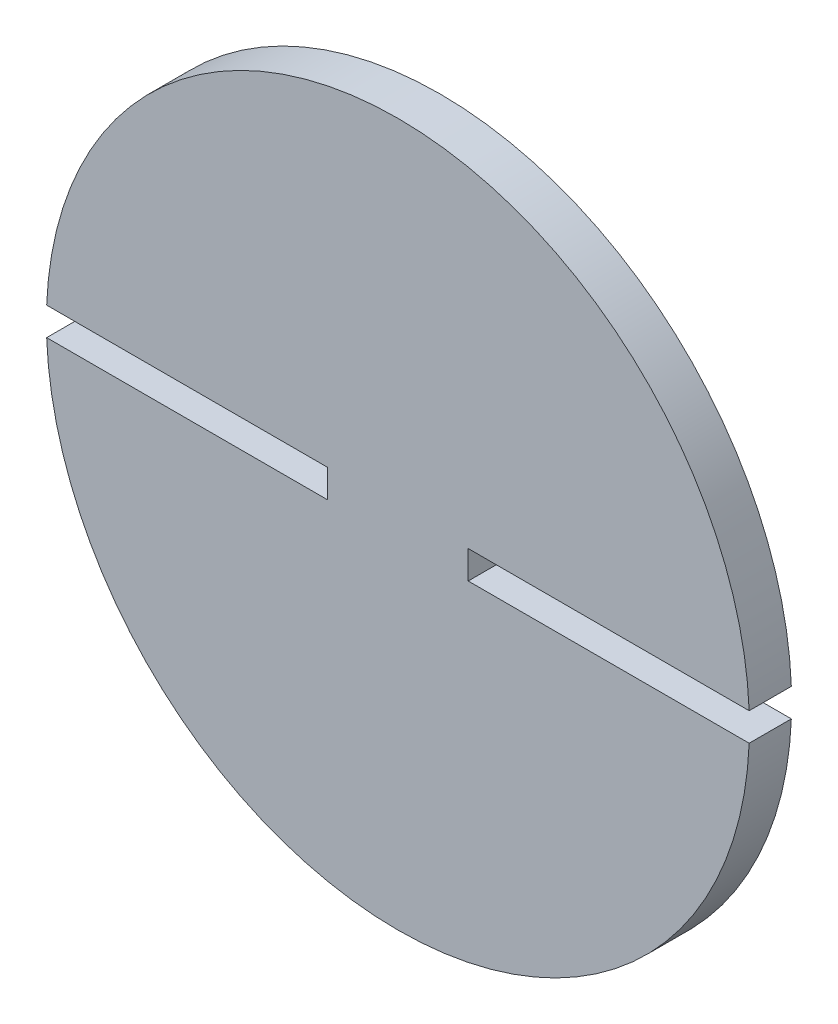
ISO-10303-21;
HEADER;
FILE_DESCRIPTION(('STEP AP214'),'2;1');
FILE_NAME('part.step','',(''),(''),'','','');
FILE_SCHEMA(('AUTOMOTIVE_DESIGN { 1 0 10303 214 1 1 1 1 }'));
ENDSEC;
DATA;
#1=APPLICATION_CONTEXT('core data for automotive mechanical design processes');
#2=APPLICATION_PROTOCOL_DEFINITION('international standard','automotive_design',2000,#1);
#3=PRODUCT_CONTEXT('',#1,'mechanical');
#4=PRODUCT('Part','Part','',(#3));
#5=PRODUCT_RELATED_PRODUCT_CATEGORY('part','',(#4));
#6=PRODUCT_DEFINITION_FORMATION('','',#4);
#7=PRODUCT_DEFINITION_CONTEXT('part definition',#1,'design');
#8=PRODUCT_DEFINITION('design','',#6,#7);
#9=PRODUCT_DEFINITION_SHAPE('','',#8);
#10=(LENGTH_UNIT() NAMED_UNIT(*) SI_UNIT(.MILLI.,.METRE.));
#11=(NAMED_UNIT(*) PLANE_ANGLE_UNIT() SI_UNIT($,.RADIAN.));
#12=(NAMED_UNIT(*) SI_UNIT($,.STERADIAN.) SOLID_ANGLE_UNIT());
#13=UNCERTAINTY_MEASURE_WITH_UNIT(LENGTH_MEASURE(1.E-05),#10,'distance_accuracy_value','');
#14=(GEOMETRIC_REPRESENTATION_CONTEXT(3) GLOBAL_UNCERTAINTY_ASSIGNED_CONTEXT((#13)) GLOBAL_UNIT_ASSIGNED_CONTEXT((#10,
#11,#12)) REPRESENTATION_CONTEXT('',''));
#15=CARTESIAN_POINT('',(0.,0.,0.));
#16=DIRECTION('',(0.,0.,1.));
#17=DIRECTION('',(1.,0.,0.));
#18=AXIS2_PLACEMENT_3D('',#15,#16,#17);
#19=CARTESIAN_POINT('',(0.,0.,3.));
#20=DIRECTION('',(0.,0.,-1.));
#21=DIRECTION('',(-1.,0.,0.));
#22=AXIS2_PLACEMENT_3D('',#19,#20,#21);
#23=CYLINDRICAL_SURFACE('',#22,25.);
#24=DIRECTION('',(0.,0.,-1.));
#25=VECTOR('',#24,1.);
#26=CARTESIAN_POINT('',(-24.9799919935936,1.,3.));
#27=LINE('',#26,#25);
#28=CARTESIAN_POINT('',(-24.9799919935936,1.,3.));
#29=VERTEX_POINT('',#28);
#30=CARTESIAN_POINT('',(-24.9799919935936,1.,0.));
#31=VERTEX_POINT('',#30);
#32=EDGE_CURVE('E129',#29,#31,#27,.T.);
#33=ORIENTED_EDGE('',*,*,#32,.F.);
#34=CARTESIAN_POINT('',(0.,0.,3.));
#35=DIRECTION('',(0.,0.,1.));
#36=DIRECTION('',(1.,0.,0.));
#37=AXIS2_PLACEMENT_3D('',#34,#35,#36);
#38=CIRCLE('',#37,25.);
#39=CARTESIAN_POINT('',(24.9799919935936,0.999999999999999,3.));
#40=VERTEX_POINT('',#39);
#41=EDGE_CURVE('E11',#40,#29,#38,.T.);
#42=ORIENTED_EDGE('',*,*,#41,.F.);
#43=DIRECTION('',(0.,0.,-1.));
#44=VECTOR('',#43,1.);
#45=CARTESIAN_POINT('',(24.9799919935936,0.999999999999999,3.));
#46=LINE('',#45,#44);
#47=CARTESIAN_POINT('',(24.9799919935936,0.999999999999999,0.));
#48=VERTEX_POINT('',#47);
#49=EDGE_CURVE('E151',#40,#48,#46,.T.);
#50=ORIENTED_EDGE('',*,*,#49,.T.);
#51=CARTESIAN_POINT('',(0.,0.,0.));
#52=DIRECTION('',(0.,0.,1.));
#53=DIRECTION('',(1.,0.,0.));
#54=AXIS2_PLACEMENT_3D('',#51,#52,#53);
#55=CIRCLE('',#54,25.);
#56=EDGE_CURVE('E37',#48,#31,#55,.T.);
#57=ORIENTED_EDGE('',*,*,#56,.T.);
#58=EDGE_LOOP('',(#33,#42,#50,#57));
#59=FACE_BOUND('',#58,.T.);
#60=ADVANCED_FACE('F33',(#59),#23,.T.);
#61=CARTESIAN_POINT('',(0.,0.,3.));
#62=DIRECTION('',(0.,0.,1.));
#63=DIRECTION('',(1.,0.,0.));
#64=AXIS2_PLACEMENT_3D('',#61,#62,#63);
#65=PLANE('',#64);
#66=ORIENTED_EDGE('',*,*,#41,.T.);
#67=DIRECTION('',(-1.,0.,0.));
#68=VECTOR('',#67,1.);
#69=CARTESIAN_POINT('',(0.,1.,3.));
#70=LINE('',#69,#68);
#71=CARTESIAN_POINT('',(-5.,1.,3.));
#72=VERTEX_POINT('',#71);
#73=EDGE_CURVE('E107',#72,#29,#70,.T.);
#74=ORIENTED_EDGE('',*,*,#73,.F.);
#75=DIRECTION('',(0.,1.,0.));
#76=VECTOR('',#75,1.);
#77=CARTESIAN_POINT('',(-5.,0.,3.));
#78=LINE('',#77,#76);
#79=CARTESIAN_POINT('',(-5.,-1.,3.));
#80=VERTEX_POINT('',#79);
#81=EDGE_CURVE('E102',#80,#72,#78,.T.);
#82=ORIENTED_EDGE('',*,*,#81,.F.);
#83=DIRECTION('',(-1.,0.,0.));
#84=VECTOR('',#83,1.);
#85=CARTESIAN_POINT('',(0.,-1.,3.));
#86=LINE('',#85,#84);
#87=CARTESIAN_POINT('',(-24.9799919935936,-1.,3.));
#88=VERTEX_POINT('',#87);
#89=EDGE_CURVE('E110',#80,#88,#86,.T.);
#90=ORIENTED_EDGE('',*,*,#89,.T.);
#91=CARTESIAN_POINT('',(24.9799919935936,-1.,3.));
#92=VERTEX_POINT('',#91);
#93=EDGE_CURVE('E42',#88,#92,#38,.T.);
#94=ORIENTED_EDGE('',*,*,#93,.T.);
#95=DIRECTION('',(1.,0.,0.));
#96=VECTOR('',#95,1.);
#97=CARTESIAN_POINT('',(0.,-1.,3.));
#98=LINE('',#97,#96);
#99=CARTESIAN_POINT('',(5.,-1.,3.));
#100=VERTEX_POINT('',#99);
#101=EDGE_CURVE('E132',#100,#92,#98,.T.);
#102=ORIENTED_EDGE('',*,*,#101,.F.);
#103=DIRECTION('',(0.,1.,0.));
#104=VECTOR('',#103,1.);
#105=CARTESIAN_POINT('',(5.,0.,3.));
#106=LINE('',#105,#104);
#107=CARTESIAN_POINT('',(5.,0.999999999999999,3.));
#108=VERTEX_POINT('',#107);
#109=EDGE_CURVE('E135',#100,#108,#106,.T.);
#110=ORIENTED_EDGE('',*,*,#109,.T.);
#111=DIRECTION('',(1.,0.,0.));
#112=VECTOR('',#111,1.);
#113=CARTESIAN_POINT('',(0.,0.999999999999999,3.));
#114=LINE('',#113,#112);
#115=EDGE_CURVE('E139',#108,#40,#114,.T.);
#116=ORIENTED_EDGE('',*,*,#115,.T.);
#117=EDGE_LOOP('',(#66,#74,#82,#90,#94,#102,#110,#116));
#118=FACE_BOUND('',#117,.T.);
#119=ADVANCED_FACE('F117',(#118),#65,.T.);
#120=CARTESIAN_POINT('',(0.,0.,0.));
#121=DIRECTION('',(0.,0.,1.));
#122=DIRECTION('',(1.,0.,0.));
#123=AXIS2_PLACEMENT_3D('',#120,#121,#122);
#124=PLANE('',#123);
#125=DIRECTION('',(-1.,0.,0.));
#126=VECTOR('',#125,1.);
#127=CARTESIAN_POINT('',(0.,1.,0.));
#128=LINE('',#127,#126);
#129=CARTESIAN_POINT('',(-5.,1.,0.));
#130=VERTEX_POINT('',#129);
#131=EDGE_CURVE('E118',#130,#31,#128,.T.);
#132=ORIENTED_EDGE('',*,*,#131,.T.);
#133=ORIENTED_EDGE('',*,*,#56,.F.);
#134=DIRECTION('',(1.,0.,0.));
#135=VECTOR('',#134,1.);
#136=CARTESIAN_POINT('',(0.,0.999999999999999,0.));
#137=LINE('',#136,#135);
#138=CARTESIAN_POINT('',(5.,0.999999999999999,0.));
#139=VERTEX_POINT('',#138);
#140=EDGE_CURVE('E136',#139,#48,#137,.T.);
#141=ORIENTED_EDGE('',*,*,#140,.F.);
#142=DIRECTION('',(0.,1.,0.));
#143=VECTOR('',#142,1.);
#144=CARTESIAN_POINT('',(5.,0.,0.));
#145=LINE('',#144,#143);
#146=CARTESIAN_POINT('',(5.,-1.,0.));
#147=VERTEX_POINT('',#146);
#148=EDGE_CURVE('E144',#147,#139,#145,.T.);
#149=ORIENTED_EDGE('',*,*,#148,.F.);
#150=DIRECTION('',(1.,0.,0.));
#151=VECTOR('',#150,1.);
#152=CARTESIAN_POINT('',(0.,-1.,0.));
#153=LINE('',#152,#151);
#154=CARTESIAN_POINT('',(24.9799919935936,-1.,0.));
#155=VERTEX_POINT('',#154);
#156=EDGE_CURVE('E57',#147,#155,#153,.T.);
#157=ORIENTED_EDGE('',*,*,#156,.T.);
#158=CARTESIAN_POINT('',(-24.9799919935936,-1.,0.));
#159=VERTEX_POINT('',#158);
#160=EDGE_CURVE('E150',#159,#155,#55,.T.);
#161=ORIENTED_EDGE('',*,*,#160,.F.);
#162=DIRECTION('',(-1.,0.,0.));
#163=VECTOR('',#162,1.);
#164=CARTESIAN_POINT('',(0.,-1.,0.));
#165=LINE('',#164,#163);
#166=CARTESIAN_POINT('',(-5.,-1.,0.));
#167=VERTEX_POINT('',#166);
#168=EDGE_CURVE('E121',#167,#159,#165,.T.);
#169=ORIENTED_EDGE('',*,*,#168,.F.);
#170=DIRECTION('',(0.,1.,0.));
#171=VECTOR('',#170,1.);
#172=CARTESIAN_POINT('',(-5.,0.,0.));
#173=LINE('',#172,#171);
#174=EDGE_CURVE('E49',#167,#130,#173,.T.);
#175=ORIENTED_EDGE('',*,*,#174,.T.);
#176=EDGE_LOOP('',(#132,#133,#141,#149,#157,#161,#169,#175));
#177=FACE_BOUND('',#176,.T.);
#178=ADVANCED_FACE('F163',(#177),#124,.F.);
#179=ORIENTED_EDGE('',*,*,#93,.F.);
#180=DIRECTION('',(0.,0.,-1.));
#181=VECTOR('',#180,1.);
#182=CARTESIAN_POINT('',(-24.9799919935936,-1.,3.));
#183=LINE('',#182,#181);
#184=EDGE_CURVE('E106',#88,#159,#183,.T.);
#185=ORIENTED_EDGE('',*,*,#184,.T.);
#186=ORIENTED_EDGE('',*,*,#160,.T.);
#187=DIRECTION('',(0.,0.,-1.));
#188=VECTOR('',#187,1.);
#189=CARTESIAN_POINT('',(24.9799919935936,-1.,3.));
#190=LINE('',#189,#188);
#191=EDGE_CURVE('E148',#92,#155,#190,.T.);
#192=ORIENTED_EDGE('',*,*,#191,.F.);
#193=EDGE_LOOP('',(#179,#185,#186,#192));
#194=FACE_BOUND('',#193,.T.);
#195=ADVANCED_FACE('F35',(#194),#23,.T.);
#196=CARTESIAN_POINT('',(0.,-1.,3.));
#197=DIRECTION('',(0.,1.,0.));
#198=DIRECTION('',(-1.,0.,0.));
#199=AXIS2_PLACEMENT_3D('',#196,#197,#198);
#200=PLANE('',#199);
#201=ORIENTED_EDGE('',*,*,#156,.F.);
#202=DIRECTION('',(0.,0.,-1.));
#203=VECTOR('',#202,1.);
#204=CARTESIAN_POINT('',(5.,-1.,3.));
#205=LINE('',#204,#203);
#206=EDGE_CURVE('E142',#100,#147,#205,.T.);
#207=ORIENTED_EDGE('',*,*,#206,.F.);
#208=ORIENTED_EDGE('',*,*,#101,.T.);
#209=ORIENTED_EDGE('',*,*,#191,.T.);
#210=EDGE_LOOP('',(#201,#207,#208,#209));
#211=FACE_BOUND('',#210,.T.);
#212=ADVANCED_FACE('F174',(#211),#200,.T.);
#213=CARTESIAN_POINT('',(0.,0.999999999999999,3.));
#214=DIRECTION('',(0.,1.,0.));
#215=DIRECTION('',(-1.,0.,0.));
#216=AXIS2_PLACEMENT_3D('',#213,#214,#215);
#217=PLANE('',#216);
#218=ORIENTED_EDGE('',*,*,#140,.T.);
#219=ORIENTED_EDGE('',*,*,#49,.F.);
#220=ORIENTED_EDGE('',*,*,#115,.F.);
#221=DIRECTION('',(0.,0.,-1.));
#222=VECTOR('',#221,1.);
#223=CARTESIAN_POINT('',(5.,0.999999999999999,3.));
#224=LINE('',#223,#222);
#225=EDGE_CURVE('E154',#108,#139,#224,.T.);
#226=ORIENTED_EDGE('',*,*,#225,.T.);
#227=EDGE_LOOP('',(#218,#219,#220,#226));
#228=FACE_BOUND('',#227,.T.);
#229=ADVANCED_FACE('F168',(#228),#217,.F.);
#230=CARTESIAN_POINT('',(5.,0.,3.));
#231=DIRECTION('',(-1.,0.,0.));
#232=DIRECTION('',(0.,0.,1.));
#233=AXIS2_PLACEMENT_3D('',#230,#231,#232);
#234=PLANE('',#233);
#235=ORIENTED_EDGE('',*,*,#148,.T.);
#236=ORIENTED_EDGE('',*,*,#225,.F.);
#237=ORIENTED_EDGE('',*,*,#109,.F.);
#238=ORIENTED_EDGE('',*,*,#206,.T.);
#239=EDGE_LOOP('',(#235,#236,#237,#238));
#240=FACE_BOUND('',#239,.T.);
#241=ADVANCED_FACE('F159',(#240),#234,.F.);
#242=CARTESIAN_POINT('',(-5.,0.,3.));
#243=DIRECTION('',(-1.,0.,0.));
#244=DIRECTION('',(0.,0.,1.));
#245=AXIS2_PLACEMENT_3D('',#242,#243,#244);
#246=PLANE('',#245);
#247=ORIENTED_EDGE('',*,*,#174,.F.);
#248=DIRECTION('',(0.,0.,-1.));
#249=VECTOR('',#248,1.);
#250=CARTESIAN_POINT('',(-5.,-1.,3.));
#251=LINE('',#250,#249);
#252=EDGE_CURVE('E98',#80,#167,#251,.T.);
#253=ORIENTED_EDGE('',*,*,#252,.F.);
#254=ORIENTED_EDGE('',*,*,#81,.T.);
#255=DIRECTION('',(0.,0.,-1.));
#256=VECTOR('',#255,1.);
#257=CARTESIAN_POINT('',(-5.,1.,3.));
#258=LINE('',#257,#256);
#259=EDGE_CURVE('E127',#72,#130,#258,.T.);
#260=ORIENTED_EDGE('',*,*,#259,.T.);
#261=EDGE_LOOP('',(#247,#253,#254,#260));
#262=FACE_BOUND('',#261,.T.);
#263=ADVANCED_FACE('F100',(#262),#246,.T.);
#264=CARTESIAN_POINT('',(0.,1.,3.));
#265=DIRECTION('',(0.,-1.,0.));
#266=DIRECTION('',(0.,0.,-1.));
#267=AXIS2_PLACEMENT_3D('',#264,#265,#266);
#268=PLANE('',#267);
#269=ORIENTED_EDGE('',*,*,#131,.F.);
#270=ORIENTED_EDGE('',*,*,#259,.F.);
#271=ORIENTED_EDGE('',*,*,#73,.T.);
#272=ORIENTED_EDGE('',*,*,#32,.T.);
#273=EDGE_LOOP('',(#269,#270,#271,#272));
#274=FACE_BOUND('',#273,.T.);
#275=ADVANCED_FACE('F177',(#274),#268,.T.);
#276=CARTESIAN_POINT('',(0.,-1.,3.));
#277=DIRECTION('',(0.,-1.,0.));
#278=DIRECTION('',(0.,0.,-1.));
#279=AXIS2_PLACEMENT_3D('',#276,#277,#278);
#280=PLANE('',#279);
#281=ORIENTED_EDGE('',*,*,#168,.T.);
#282=ORIENTED_EDGE('',*,*,#184,.F.);
#283=ORIENTED_EDGE('',*,*,#89,.F.);
#284=ORIENTED_EDGE('',*,*,#252,.T.);
#285=EDGE_LOOP('',(#281,#282,#283,#284));
#286=FACE_BOUND('',#285,.T.);
#287=ADVANCED_FACE('F111',(#286),#280,.F.);
#288=CLOSED_SHELL('',(#60,#119,#178,#195,#212,#229,#241,#263,#275,#287));
#289=MANIFOLD_SOLID_BREP('B2',#288);
#290=ADVANCED_BREP_SHAPE_REPRESENTATION('',(#18,#289),#14);
#291=SHAPE_DEFINITION_REPRESENTATION(#9,#290);
ENDSEC;
END-ISO-10303-21;
